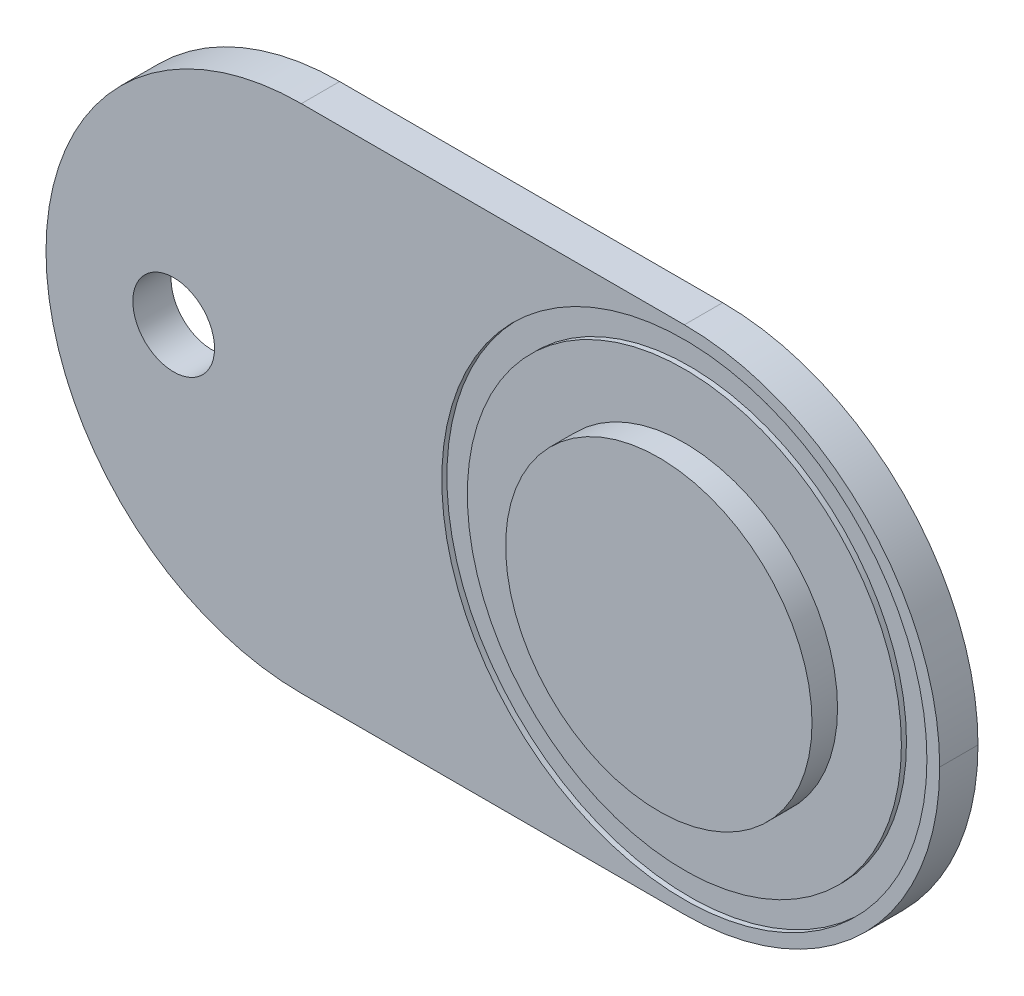
ISO-10303-21;
HEADER;
FILE_DESCRIPTION(('STEP AP214'),'2;1');
FILE_NAME('part.step','',(''),(''),'','','');
FILE_SCHEMA(('AUTOMOTIVE_DESIGN { 1 0 10303 214 1 1 1 1 }'));
ENDSEC;
DATA;
#1=APPLICATION_CONTEXT('core data for automotive mechanical design processes');
#2=APPLICATION_PROTOCOL_DEFINITION('international standard','automotive_design',2000,#1);
#3=PRODUCT_CONTEXT('',#1,'mechanical');
#4=PRODUCT('Part','Part','',(#3));
#5=PRODUCT_RELATED_PRODUCT_CATEGORY('part','',(#4));
#6=PRODUCT_DEFINITION_FORMATION('','',#4);
#7=PRODUCT_DEFINITION_CONTEXT('part definition',#1,'design');
#8=PRODUCT_DEFINITION('design','',#6,#7);
#9=PRODUCT_DEFINITION_SHAPE('','',#8);
#10=(LENGTH_UNIT() NAMED_UNIT(*) SI_UNIT(.MILLI.,.METRE.));
#11=(NAMED_UNIT(*) PLANE_ANGLE_UNIT() SI_UNIT($,.RADIAN.));
#12=(NAMED_UNIT(*) SI_UNIT($,.STERADIAN.) SOLID_ANGLE_UNIT());
#13=UNCERTAINTY_MEASURE_WITH_UNIT(LENGTH_MEASURE(1.E-05),#10,'distance_accuracy_value','');
#14=(GEOMETRIC_REPRESENTATION_CONTEXT(3) GLOBAL_UNCERTAINTY_ASSIGNED_CONTEXT((#13)) GLOBAL_UNIT_ASSIGNED_CONTEXT((#10,
#11,#12)) REPRESENTATION_CONTEXT('',''));
#15=CARTESIAN_POINT('',(0.,0.,0.));
#16=DIRECTION('',(0.,0.,1.));
#17=DIRECTION('',(1.,0.,0.));
#18=AXIS2_PLACEMENT_3D('',#15,#16,#17);
#19=CARTESIAN_POINT('',(0.,-10.,1.5));
#20=DIRECTION('',(0.,0.,1.));
#21=DIRECTION('',(1.,0.,0.));
#22=AXIS2_PLACEMENT_3D('',#19,#20,#21);
#23=PLANE('',#22);
#24=CARTESIAN_POINT('',(25.,0.,1.5));
#25=DIRECTION('',(0.,0.,1.));
#26=DIRECTION('',(1.,0.,0.));
#27=AXIS2_PLACEMENT_3D('',#24,#25,#26);
#28=CIRCLE('',#27,9.5);
#29=CARTESIAN_POINT('',(34.5,0.,1.5));
#30=VERTEX_POINT('',#29);
#31=EDGE_CURVE('E155',#30,#30,#28,.T.);
#32=ORIENTED_EDGE('',*,*,#31,.F.);
#33=EDGE_LOOP('',(#32));
#34=FACE_BOUND('',#33,.T.);
#35=CARTESIAN_POINT('',(25.,0.,1.5));
#36=DIRECTION('',(0.,0.,1.));
#37=DIRECTION('',(1.,0.,0.));
#38=AXIS2_PLACEMENT_3D('',#35,#36,#37);
#39=CIRCLE('',#38,10.);
#40=CARTESIAN_POINT('',(25.,-10.,1.5));
#41=VERTEX_POINT('',#40);
#42=CARTESIAN_POINT('',(35.,0.,1.5));
#43=VERTEX_POINT('',#42);
#44=EDGE_CURVE('E56',#41,#43,#39,.T.);
#45=ORIENTED_EDGE('',*,*,#44,.T.);
#46=CARTESIAN_POINT('',(25.,0.,1.5));
#47=DIRECTION('',(0.,0.,1.));
#48=DIRECTION('',(1.,0.,0.));
#49=AXIS2_PLACEMENT_3D('',#46,#47,#48);
#50=CIRCLE('',#49,10.);
#51=CARTESIAN_POINT('',(25.,10.,1.5));
#52=VERTEX_POINT('',#51);
#53=EDGE_CURVE('E132',#43,#52,#50,.T.);
#54=ORIENTED_EDGE('',*,*,#53,.T.);
#55=DIRECTION('',(-1.,0.,0.));
#56=VECTOR('',#55,1.);
#57=CARTESIAN_POINT('',(0.,10.,1.5));
#58=LINE('',#57,#56);
#59=CARTESIAN_POINT('',(10.,10.,1.5));
#60=VERTEX_POINT('',#59);
#61=EDGE_CURVE('E104',#52,#60,#58,.T.);
#62=ORIENTED_EDGE('',*,*,#61,.T.);
#63=CARTESIAN_POINT('',(10.,0.,1.5));
#64=DIRECTION('',(0.,0.,1.));
#65=DIRECTION('',(1.,0.,0.));
#66=AXIS2_PLACEMENT_3D('',#63,#64,#65);
#67=CIRCLE('',#66,10.);
#68=CARTESIAN_POINT('',(0.,0.,1.5));
#69=VERTEX_POINT('',#68);
#70=EDGE_CURVE('E129',#60,#69,#67,.T.);
#71=ORIENTED_EDGE('',*,*,#70,.T.);
#72=CARTESIAN_POINT('',(10.,0.,1.5));
#73=DIRECTION('',(0.,0.,1.));
#74=DIRECTION('',(1.,0.,0.));
#75=AXIS2_PLACEMENT_3D('',#72,#73,#74);
#76=CIRCLE('',#75,10.);
#77=CARTESIAN_POINT('',(10.,-10.,1.5));
#78=VERTEX_POINT('',#77);
#79=EDGE_CURVE('E110',#69,#78,#76,.T.);
#80=ORIENTED_EDGE('',*,*,#79,.T.);
#81=DIRECTION('',(1.,0.,0.));
#82=VECTOR('',#81,1.);
#83=CARTESIAN_POINT('',(0.,-10.,1.5));
#84=LINE('',#83,#82);
#85=EDGE_CURVE('E135',#78,#41,#84,.T.);
#86=ORIENTED_EDGE('',*,*,#85,.T.);
#87=EDGE_LOOP('',(#45,#54,#62,#71,#80,#86));
#88=FACE_BOUND('',#87,.T.);
#89=CARTESIAN_POINT('',(5.,0.,1.5));
#90=DIRECTION('',(0.,0.,1.));
#91=DIRECTION('',(1.,0.,0.));
#92=AXIS2_PLACEMENT_3D('',#89,#90,#91);
#93=CIRCLE('',#92,1.6);
#94=CARTESIAN_POINT('',(6.6,0.,1.5));
#95=VERTEX_POINT('',#94);
#96=EDGE_CURVE('E141',#95,#95,#93,.T.);
#97=ORIENTED_EDGE('',*,*,#96,.F.);
#98=EDGE_LOOP('',(#97));
#99=FACE_BOUND('',#98,.T.);
#100=ADVANCED_FACE('F39',(#34,#88,#99),#23,.T.);
#101=CARTESIAN_POINT('',(0.,-10.,1.5));
#102=DIRECTION('',(0.,1.,0.));
#103=DIRECTION('',(0.,0.,1.));
#104=AXIS2_PLACEMENT_3D('',#101,#102,#103);
#105=PLANE('',#104);
#106=DIRECTION('',(1.,0.,0.));
#107=VECTOR('',#106,1.);
#108=CARTESIAN_POINT('',(0.,-10.,0.));
#109=LINE('',#108,#107);
#110=CARTESIAN_POINT('',(10.,-10.,0.));
#111=VERTEX_POINT('',#110);
#112=CARTESIAN_POINT('',(25.,-10.,0.));
#113=VERTEX_POINT('',#112);
#114=EDGE_CURVE('E101',#111,#113,#109,.T.);
#115=ORIENTED_EDGE('',*,*,#114,.T.);
#116=DIRECTION('',(0.,0.,-1.));
#117=VECTOR('',#116,1.);
#118=CARTESIAN_POINT('',(25.,-10.,1.5));
#119=LINE('',#118,#117);
#120=EDGE_CURVE('E12',#113,#41,#119,.F.);
#121=ORIENTED_EDGE('',*,*,#120,.T.);
#122=ORIENTED_EDGE('',*,*,#85,.F.);
#123=DIRECTION('',(0.,0.,-1.));
#124=VECTOR('',#123,1.);
#125=CARTESIAN_POINT('',(10.,-10.,1.5));
#126=LINE('',#125,#124);
#127=EDGE_CURVE('E48',#78,#111,#126,.T.);
#128=ORIENTED_EDGE('',*,*,#127,.T.);
#129=EDGE_LOOP('',(#115,#121,#122,#128));
#130=FACE_BOUND('',#129,.T.);
#131=ADVANCED_FACE('F134',(#130),#105,.F.);
#132=CARTESIAN_POINT('',(0.,10.,1.5));
#133=DIRECTION('',(0.,-1.,0.));
#134=DIRECTION('',(0.,0.,-1.));
#135=AXIS2_PLACEMENT_3D('',#132,#133,#134);
#136=PLANE('',#135);
#137=DIRECTION('',(-1.,0.,0.));
#138=VECTOR('',#137,1.);
#139=CARTESIAN_POINT('',(0.,10.,0.));
#140=LINE('',#139,#138);
#141=CARTESIAN_POINT('',(25.,10.,0.));
#142=VERTEX_POINT('',#141);
#143=CARTESIAN_POINT('',(10.,10.,0.));
#144=VERTEX_POINT('',#143);
#145=EDGE_CURVE('E136',#142,#144,#140,.T.);
#146=ORIENTED_EDGE('',*,*,#145,.T.);
#147=DIRECTION('',(0.,0.,-1.));
#148=VECTOR('',#147,1.);
#149=CARTESIAN_POINT('',(10.,10.,1.5));
#150=LINE('',#149,#148);
#151=EDGE_CURVE('E116',#144,#60,#150,.F.);
#152=ORIENTED_EDGE('',*,*,#151,.T.);
#153=ORIENTED_EDGE('',*,*,#61,.F.);
#154=DIRECTION('',(0.,0.,-1.));
#155=VECTOR('',#154,1.);
#156=CARTESIAN_POINT('',(25.,10.,1.5));
#157=LINE('',#156,#155);
#158=EDGE_CURVE('E124',#52,#142,#157,.T.);
#159=ORIENTED_EDGE('',*,*,#158,.T.);
#160=EDGE_LOOP('',(#146,#152,#153,#159));
#161=FACE_BOUND('',#160,.T.);
#162=ADVANCED_FACE('F199',(#161),#136,.F.);
#163=CARTESIAN_POINT('',(0.,-10.,0.));
#164=DIRECTION('',(0.,0.,1.));
#165=DIRECTION('',(1.,0.,0.));
#166=AXIS2_PLACEMENT_3D('',#163,#164,#165);
#167=PLANE('',#166);
#168=CARTESIAN_POINT('',(5.,0.,0.));
#169=DIRECTION('',(0.,0.,1.));
#170=DIRECTION('',(1.,0.,0.));
#171=AXIS2_PLACEMENT_3D('',#168,#169,#170);
#172=CIRCLE('',#171,1.6);
#173=CARTESIAN_POINT('',(6.6,0.,0.));
#174=VERTEX_POINT('',#173);
#175=EDGE_CURVE('E144',#174,#174,#172,.T.);
#176=ORIENTED_EDGE('',*,*,#175,.T.);
#177=EDGE_LOOP('',(#176));
#178=FACE_BOUND('',#177,.T.);
#179=ORIENTED_EDGE('',*,*,#145,.F.);
#180=CARTESIAN_POINT('',(25.,0.,0.));
#181=DIRECTION('',(0.,0.,1.));
#182=DIRECTION('',(1.,0.,0.));
#183=AXIS2_PLACEMENT_3D('',#180,#181,#182);
#184=CIRCLE('',#183,10.);
#185=CARTESIAN_POINT('',(35.,0.,0.));
#186=VERTEX_POINT('',#185);
#187=EDGE_CURVE('E119',#142,#186,#184,.F.);
#188=ORIENTED_EDGE('',*,*,#187,.T.);
#189=CARTESIAN_POINT('',(25.,0.,0.));
#190=DIRECTION('',(0.,0.,1.));
#191=DIRECTION('',(1.,0.,0.));
#192=AXIS2_PLACEMENT_3D('',#189,#190,#191);
#193=CIRCLE('',#192,10.);
#194=EDGE_CURVE('E117',#186,#113,#193,.F.);
#195=ORIENTED_EDGE('',*,*,#194,.T.);
#196=ORIENTED_EDGE('',*,*,#114,.F.);
#197=CARTESIAN_POINT('',(10.,0.,0.));
#198=DIRECTION('',(0.,0.,1.));
#199=DIRECTION('',(1.,0.,0.));
#200=AXIS2_PLACEMENT_3D('',#197,#198,#199);
#201=CIRCLE('',#200,10.);
#202=CARTESIAN_POINT('',(0.,0.,0.));
#203=VERTEX_POINT('',#202);
#204=EDGE_CURVE('E94',#111,#203,#201,.F.);
#205=ORIENTED_EDGE('',*,*,#204,.T.);
#206=CARTESIAN_POINT('',(10.,0.,0.));
#207=DIRECTION('',(0.,0.,1.));
#208=DIRECTION('',(1.,0.,0.));
#209=AXIS2_PLACEMENT_3D('',#206,#207,#208);
#210=CIRCLE('',#209,10.);
#211=EDGE_CURVE('E99',#203,#144,#210,.F.);
#212=ORIENTED_EDGE('',*,*,#211,.T.);
#213=EDGE_LOOP('',(#179,#188,#195,#196,#205,#212));
#214=FACE_BOUND('',#213,.T.);
#215=ADVANCED_FACE('F97',(#178,#214),#167,.F.);
#216=CARTESIAN_POINT('',(5.,0.,0.));
#217=DIRECTION('',(0.,0.,1.));
#218=DIRECTION('',(1.,0.,0.));
#219=AXIS2_PLACEMENT_3D('',#216,#217,#218);
#220=CYLINDRICAL_SURFACE('',#219,1.6);
#221=ORIENTED_EDGE('',*,*,#175,.F.);
#222=EDGE_LOOP('',(#221));
#223=FACE_BOUND('',#222,.T.);
#224=ORIENTED_EDGE('',*,*,#96,.T.);
#225=EDGE_LOOP('',(#224));
#226=FACE_BOUND('',#225,.T.);
#227=ADVANCED_FACE('F190',(#223,#226),#220,.F.);
#228=CARTESIAN_POINT('',(10.,0.,1.5));
#229=DIRECTION('',(0.,0.,-1.));
#230=DIRECTION('',(-1.,0.,0.));
#231=AXIS2_PLACEMENT_3D('',#228,#229,#230);
#232=CYLINDRICAL_SURFACE('',#231,10.);
#233=ORIENTED_EDGE('',*,*,#127,.F.);
#234=ORIENTED_EDGE('',*,*,#79,.F.);
#235=DIRECTION('',(0.,0.,-1.));
#236=VECTOR('',#235,1.);
#237=CARTESIAN_POINT('',(0.,0.,1.5));
#238=LINE('',#237,#236);
#239=EDGE_CURVE('E108',#203,#69,#238,.F.);
#240=ORIENTED_EDGE('',*,*,#239,.F.);
#241=ORIENTED_EDGE('',*,*,#204,.F.);
#242=EDGE_LOOP('',(#233,#234,#240,#241));
#243=FACE_BOUND('',#242,.T.);
#244=ADVANCED_FACE('F109',(#243),#232,.T.);
#245=CARTESIAN_POINT('',(10.,0.,1.5));
#246=DIRECTION('',(0.,0.,-1.));
#247=DIRECTION('',(-1.,0.,0.));
#248=AXIS2_PLACEMENT_3D('',#245,#246,#247);
#249=CYLINDRICAL_SURFACE('',#248,10.);
#250=ORIENTED_EDGE('',*,*,#70,.F.);
#251=ORIENTED_EDGE('',*,*,#151,.F.);
#252=ORIENTED_EDGE('',*,*,#211,.F.);
#253=ORIENTED_EDGE('',*,*,#239,.T.);
#254=EDGE_LOOP('',(#250,#251,#252,#253));
#255=FACE_BOUND('',#254,.T.);
#256=ADVANCED_FACE('F114',(#255),#249,.T.);
#257=CARTESIAN_POINT('',(25.,0.,1.5));
#258=DIRECTION('',(0.,0.,-1.));
#259=DIRECTION('',(-1.,0.,0.));
#260=AXIS2_PLACEMENT_3D('',#257,#258,#259);
#261=CYLINDRICAL_SURFACE('',#260,10.);
#262=DIRECTION('',(0.,0.,-1.));
#263=VECTOR('',#262,1.);
#264=CARTESIAN_POINT('',(35.,0.,1.5));
#265=LINE('',#264,#263);
#266=EDGE_CURVE('E43',#43,#186,#265,.T.);
#267=ORIENTED_EDGE('',*,*,#266,.F.);
#268=ORIENTED_EDGE('',*,*,#44,.F.);
#269=ORIENTED_EDGE('',*,*,#120,.F.);
#270=ORIENTED_EDGE('',*,*,#194,.F.);
#271=EDGE_LOOP('',(#267,#268,#269,#270));
#272=FACE_BOUND('',#271,.T.);
#273=ADVANCED_FACE('F41',(#272),#261,.T.);
#274=CARTESIAN_POINT('',(25.,0.,1.5));
#275=DIRECTION('',(0.,0.,-1.));
#276=DIRECTION('',(-1.,0.,0.));
#277=AXIS2_PLACEMENT_3D('',#274,#275,#276);
#278=CYLINDRICAL_SURFACE('',#277,10.);
#279=ORIENTED_EDGE('',*,*,#53,.F.);
#280=ORIENTED_EDGE('',*,*,#266,.T.);
#281=ORIENTED_EDGE('',*,*,#187,.F.);
#282=ORIENTED_EDGE('',*,*,#158,.F.);
#283=EDGE_LOOP('',(#279,#280,#281,#282));
#284=FACE_BOUND('',#283,.T.);
#285=ADVANCED_FACE('F180',(#284),#278,.T.);
#286=CARTESIAN_POINT('',(25.,0.,1.3));
#287=DIRECTION('',(0.,0.,1.));
#288=DIRECTION('',(1.,0.,0.));
#289=AXIS2_PLACEMENT_3D('',#286,#287,#288);
#290=CYLINDRICAL_SURFACE('',#289,9.5);
#291=CARTESIAN_POINT('',(25.,0.,1.3));
#292=DIRECTION('',(0.,0.,1.));
#293=DIRECTION('',(1.,0.,0.));
#294=AXIS2_PLACEMENT_3D('',#291,#292,#293);
#295=CIRCLE('',#294,9.5);
#296=CARTESIAN_POINT('',(34.5,0.,1.3));
#297=VERTEX_POINT('',#296);
#298=EDGE_CURVE('E158',#297,#297,#295,.T.);
#299=ORIENTED_EDGE('',*,*,#298,.F.);
#300=EDGE_LOOP('',(#299));
#301=FACE_BOUND('',#300,.T.);
#302=ORIENTED_EDGE('',*,*,#31,.T.);
#303=EDGE_LOOP('',(#302));
#304=FACE_BOUND('',#303,.T.);
#305=ADVANCED_FACE('F174',(#301,#304),#290,.F.);
#306=CARTESIAN_POINT('',(25.,0.,1.3));
#307=DIRECTION('',(0.,0.,1.));
#308=DIRECTION('',(1.,0.,0.));
#309=AXIS2_PLACEMENT_3D('',#306,#307,#308);
#310=PLANE('',#309);
#311=CARTESIAN_POINT('',(25.,0.,1.3));
#312=DIRECTION('',(0.,0.,1.));
#313=DIRECTION('',(1.,0.,0.));
#314=AXIS2_PLACEMENT_3D('',#311,#312,#313);
#315=CIRCLE('',#314,8.5);
#316=CARTESIAN_POINT('',(33.5,0.,1.3));
#317=VERTEX_POINT('',#316);
#318=EDGE_CURVE('E159',#317,#317,#315,.T.);
#319=ORIENTED_EDGE('',*,*,#318,.F.);
#320=EDGE_LOOP('',(#319));
#321=FACE_BOUND('',#320,.T.);
#322=ORIENTED_EDGE('',*,*,#298,.T.);
#323=EDGE_LOOP('',(#322));
#324=FACE_BOUND('',#323,.T.);
#325=ADVANCED_FACE('F171',(#321,#324),#310,.T.);
#326=CARTESIAN_POINT('',(25.,0.,1.3));
#327=DIRECTION('',(0.,0.,1.));
#328=DIRECTION('',(1.,0.,0.));
#329=AXIS2_PLACEMENT_3D('',#326,#327,#328);
#330=CYLINDRICAL_SURFACE('',#329,8.5);
#331=ORIENTED_EDGE('',*,*,#318,.T.);
#332=EDGE_LOOP('',(#331));
#333=FACE_BOUND('',#332,.T.);
#334=CARTESIAN_POINT('',(25.,0.,1.5));
#335=DIRECTION('',(0.,0.,1.));
#336=DIRECTION('',(1.,0.,0.));
#337=AXIS2_PLACEMENT_3D('',#334,#335,#336);
#338=CIRCLE('',#337,8.5);
#339=CARTESIAN_POINT('',(33.5,0.,1.5));
#340=VERTEX_POINT('',#339);
#341=EDGE_CURVE('E162',#340,#340,#338,.T.);
#342=ORIENTED_EDGE('',*,*,#341,.F.);
#343=EDGE_LOOP('',(#342));
#344=FACE_BOUND('',#343,.T.);
#345=ADVANCED_FACE('F168',(#333,#344),#330,.T.);
#346=CARTESIAN_POINT('',(25.,0.,2.5));
#347=DIRECTION('',(0.,0.,1.));
#348=DIRECTION('',(1.,0.,0.));
#349=AXIS2_PLACEMENT_3D('',#346,#347,#348);
#350=PLANE('',#349);
#351=CARTESIAN_POINT('',(25.,0.,2.5));
#352=DIRECTION('',(0.,0.,1.));
#353=DIRECTION('',(1.,0.,0.));
#354=AXIS2_PLACEMENT_3D('',#351,#352,#353);
#355=CIRCLE('',#354,6.);
#356=CARTESIAN_POINT('',(31.,0.,2.5));
#357=VERTEX_POINT('',#356);
#358=EDGE_CURVE('E149',#357,#357,#355,.T.);
#359=ORIENTED_EDGE('',*,*,#358,.T.);
#360=EDGE_LOOP('',(#359));
#361=FACE_BOUND('',#360,.T.);
#362=ADVANCED_FACE('F257',(#361),#350,.T.);
#363=CARTESIAN_POINT('',(25.,0.,2.5));
#364=DIRECTION('',(0.,0.,-1.));
#365=DIRECTION('',(-1.,0.,0.));
#366=AXIS2_PLACEMENT_3D('',#363,#364,#365);
#367=CYLINDRICAL_SURFACE('',#366,6.);
#368=ORIENTED_EDGE('',*,*,#358,.F.);
#369=EDGE_LOOP('',(#368));
#370=FACE_BOUND('',#369,.T.);
#371=CARTESIAN_POINT('',(25.,0.,1.5));
#372=DIRECTION('',(0.,0.,1.));
#373=DIRECTION('',(1.,0.,0.));
#374=AXIS2_PLACEMENT_3D('',#371,#372,#373);
#375=CIRCLE('',#374,6.);
#376=CARTESIAN_POINT('',(31.,0.,1.5));
#377=VERTEX_POINT('',#376);
#378=EDGE_CURVE('E112',#377,#377,#375,.T.);
#379=ORIENTED_EDGE('',*,*,#378,.T.);
#380=EDGE_LOOP('',(#379));
#381=FACE_BOUND('',#380,.T.);
#382=ADVANCED_FACE('F202',(#370,#381),#367,.T.);
#383=ORIENTED_EDGE('',*,*,#378,.F.);
#384=EDGE_LOOP('',(#383));
#385=FACE_BOUND('',#384,.T.);
#386=ORIENTED_EDGE('',*,*,#341,.T.);
#387=EDGE_LOOP('',(#386));
#388=FACE_BOUND('',#387,.T.);
#389=ADVANCED_FACE('F186',(#385,#388),#23,.T.);
#390=CLOSED_SHELL('',(#100,#131,#162,#215,#227,#244,#256,#273,#285,#305,#325,#345,#362,#382,#389));
#391=MANIFOLD_SOLID_BREP('B2',#390);
#392=ADVANCED_BREP_SHAPE_REPRESENTATION('',(#18,#391),#14);
#393=SHAPE_DEFINITION_REPRESENTATION(#9,#392);
ENDSEC;
END-ISO-10303-21;
